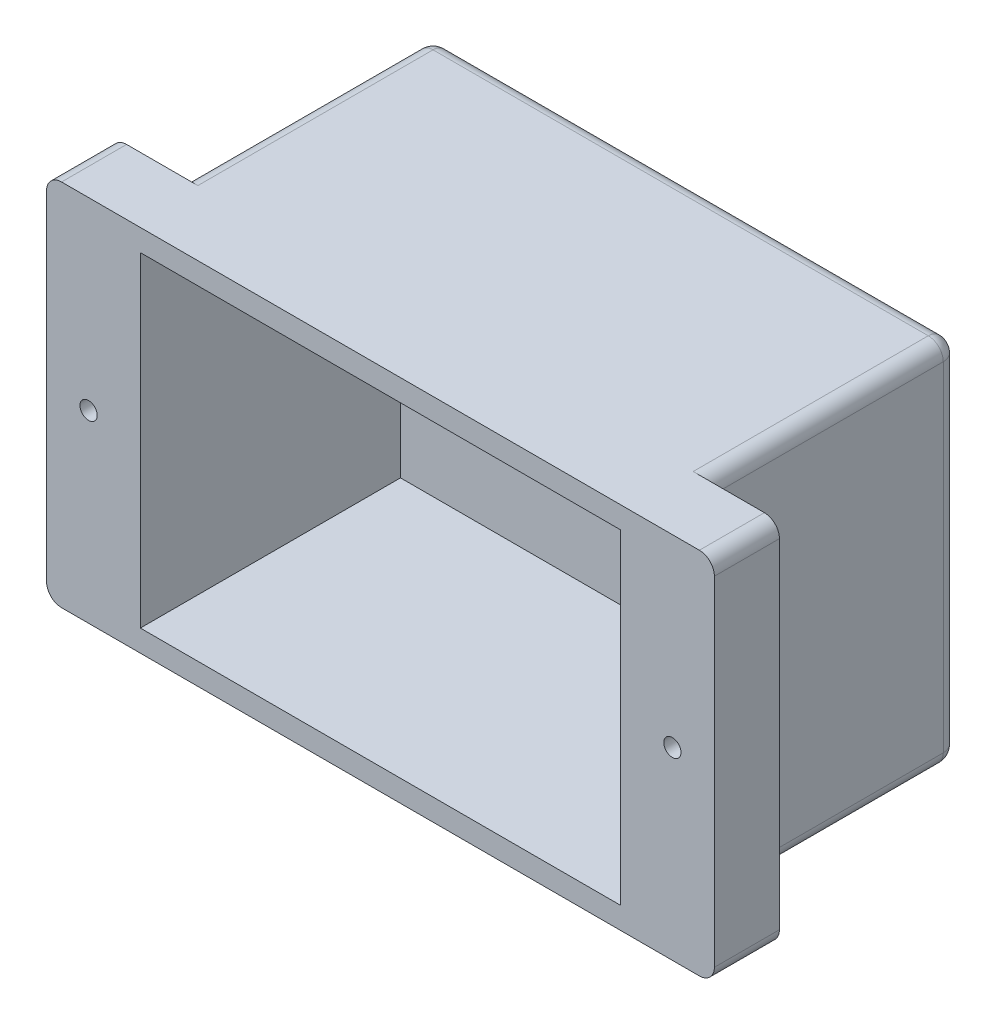
ISO-10303-21;
HEADER;
FILE_DESCRIPTION(('STEP AP214'),'2;1');
FILE_NAME('part.step','',(''),(''),'','','');
FILE_SCHEMA(('AUTOMOTIVE_DESIGN { 1 0 10303 214 1 1 1 1 }'));
ENDSEC;
DATA;
#1=APPLICATION_CONTEXT('core data for automotive mechanical design processes');
#2=APPLICATION_PROTOCOL_DEFINITION('international standard','automotive_design',2000,#1);
#3=PRODUCT_CONTEXT('',#1,'mechanical');
#4=PRODUCT('Part','Part','',(#3));
#5=PRODUCT_RELATED_PRODUCT_CATEGORY('part','',(#4));
#6=PRODUCT_DEFINITION_FORMATION('','',#4);
#7=PRODUCT_DEFINITION_CONTEXT('part definition',#1,'design');
#8=PRODUCT_DEFINITION('design','',#6,#7);
#9=PRODUCT_DEFINITION_SHAPE('','',#8);
#10=(LENGTH_UNIT() NAMED_UNIT(*) SI_UNIT(.MILLI.,.METRE.));
#11=(NAMED_UNIT(*) PLANE_ANGLE_UNIT() SI_UNIT($,.RADIAN.));
#12=(NAMED_UNIT(*) SI_UNIT($,.STERADIAN.) SOLID_ANGLE_UNIT());
#13=UNCERTAINTY_MEASURE_WITH_UNIT(LENGTH_MEASURE(1.E-05),#10,'distance_accuracy_value','');
#14=(GEOMETRIC_REPRESENTATION_CONTEXT(3) GLOBAL_UNCERTAINTY_ASSIGNED_CONTEXT((#13)) GLOBAL_UNIT_ASSIGNED_CONTEXT((#10,
#11,#12)) REPRESENTATION_CONTEXT('',''));
#15=CARTESIAN_POINT('',(0.,0.,0.));
#16=DIRECTION('',(0.,0.,1.));
#17=DIRECTION('',(1.,0.,0.));
#18=AXIS2_PLACEMENT_3D('',#15,#16,#17);
#19=CARTESIAN_POINT('',(0.,0.,-5.5));
#20=DIRECTION('',(0.,0.,1.));
#21=DIRECTION('',(1.,0.,0.));
#22=AXIS2_PLACEMENT_3D('',#19,#20,#21);
#23=PLANE('',#22);
#24=CARTESIAN_POINT('',(58.35,0.,-5.5));
#25=DIRECTION('',(0.,0.,1.));
#26=DIRECTION('',(1.,0.,0.));
#27=AXIS2_PLACEMENT_3D('',#24,#25,#26);
#28=CIRCLE('',#27,1.725);
#29=CARTESIAN_POINT('',(60.075,0.,-5.5));
#30=VERTEX_POINT('',#29);
#31=EDGE_CURVE('E276',#30,#30,#28,.T.);
#32=ORIENTED_EDGE('',*,*,#31,.T.);
#33=EDGE_LOOP('',(#32));
#34=FACE_BOUND('',#33,.T.);
#35=DIRECTION('',(0.,1.,0.));
#36=VECTOR('',#35,1.);
#37=CARTESIAN_POINT('',(66.75,-36.85,-5.5));
#38=LINE('',#37,#36);
#39=CARTESIAN_POINT('',(66.75,-33.85,-5.5));
#40=VERTEX_POINT('',#39);
#41=CARTESIAN_POINT('',(66.75,33.85,-5.5));
#42=VERTEX_POINT('',#41);
#43=EDGE_CURVE('E292',#40,#42,#38,.T.);
#44=ORIENTED_EDGE('',*,*,#43,.F.);
#45=CARTESIAN_POINT('',(63.75,-33.85,-5.5));
#46=DIRECTION('',(0.,0.,1.));
#47=DIRECTION('',(1.,0.,0.));
#48=AXIS2_PLACEMENT_3D('',#45,#46,#47);
#49=CIRCLE('',#48,3.);
#50=CARTESIAN_POINT('',(63.75,-36.85,-5.5));
#51=VERTEX_POINT('',#50);
#52=EDGE_CURVE('E329',#40,#51,#49,.F.);
#53=ORIENTED_EDGE('',*,*,#52,.T.);
#54=DIRECTION('',(1.,0.,0.));
#55=VECTOR('',#54,1.);
#56=CARTESIAN_POINT('',(66.75,-36.85,-5.5));
#57=LINE('',#56,#55);
#58=CARTESIAN_POINT('',(49.5,-36.85,-5.5));
#59=VERTEX_POINT('',#58);
#60=EDGE_CURVE('E288',#59,#51,#57,.T.);
#61=ORIENTED_EDGE('',*,*,#60,.F.);
#62=CARTESIAN_POINT('',(49.5,-33.85,-5.5));
#63=DIRECTION('',(0.,0.,1.));
#64=DIRECTION('',(1.,0.,0.));
#65=AXIS2_PLACEMENT_3D('',#62,#63,#64);
#66=CIRCLE('',#65,3.);
#67=CARTESIAN_POINT('',(52.5,-33.85,-5.5));
#68=VERTEX_POINT('',#67);
#69=EDGE_CURVE('E402',#59,#68,#66,.T.);
#70=ORIENTED_EDGE('',*,*,#69,.T.);
#71=DIRECTION('',(0.,-1.,0.));
#72=VECTOR('',#71,1.);
#73=CARTESIAN_POINT('',(52.5,-36.85,-5.5));
#74=LINE('',#73,#72);
#75=CARTESIAN_POINT('',(52.5,33.85,-5.5));
#76=VERTEX_POINT('',#75);
#77=EDGE_CURVE('E240',#76,#68,#74,.T.);
#78=ORIENTED_EDGE('',*,*,#77,.F.);
#79=CARTESIAN_POINT('',(49.5,33.85,-5.5));
#80=DIRECTION('',(0.,0.,1.));
#81=DIRECTION('',(1.,0.,0.));
#82=AXIS2_PLACEMENT_3D('',#79,#80,#81);
#83=CIRCLE('',#82,3.);
#84=CARTESIAN_POINT('',(49.5,36.85,-5.5));
#85=VERTEX_POINT('',#84);
#86=EDGE_CURVE('E11',#76,#85,#83,.T.);
#87=ORIENTED_EDGE('',*,*,#86,.T.);
#88=DIRECTION('',(-1.,0.,0.));
#89=VECTOR('',#88,1.);
#90=CARTESIAN_POINT('',(66.75,36.85,-5.5));
#91=LINE('',#90,#89);
#92=CARTESIAN_POINT('',(63.75,36.85,-5.5));
#93=VERTEX_POINT('',#92);
#94=EDGE_CURVE('E297',#93,#85,#91,.T.);
#95=ORIENTED_EDGE('',*,*,#94,.F.);
#96=CARTESIAN_POINT('',(63.75,33.85,-5.5));
#97=DIRECTION('',(0.,0.,1.));
#98=DIRECTION('',(1.,0.,0.));
#99=AXIS2_PLACEMENT_3D('',#96,#97,#98);
#100=CIRCLE('',#99,3.);
#101=EDGE_CURVE('E326',#93,#42,#100,.F.);
#102=ORIENTED_EDGE('',*,*,#101,.T.);
#103=EDGE_LOOP('',(#44,#53,#61,#70,#78,#87,#95,#102));
#104=FACE_BOUND('',#103,.T.);
#105=ADVANCED_FACE('F39',(#34,#104),#23,.F.);
#106=CARTESIAN_POINT('',(-58.35,0.,-5.5));
#107=DIRECTION('',(0.,0.,1.));
#108=DIRECTION('',(1.,0.,0.));
#109=AXIS2_PLACEMENT_3D('',#106,#107,#108);
#110=CIRCLE('',#109,1.725);
#111=CARTESIAN_POINT('',(-56.625,0.,-5.5));
#112=VERTEX_POINT('',#111);
#113=EDGE_CURVE('E280',#112,#112,#110,.T.);
#114=ORIENTED_EDGE('',*,*,#113,.T.);
#115=EDGE_LOOP('',(#114));
#116=FACE_BOUND('',#115,.T.);
#117=CARTESIAN_POINT('',(-63.75,-36.85,-5.5));
#118=VERTEX_POINT('',#117);
#119=CARTESIAN_POINT('',(-49.5,-36.85,-5.5));
#120=VERTEX_POINT('',#119);
#121=EDGE_CURVE('E289',#118,#120,#57,.T.);
#122=ORIENTED_EDGE('',*,*,#121,.F.);
#123=CARTESIAN_POINT('',(-63.75,-33.85,-5.5));
#124=DIRECTION('',(0.,0.,1.));
#125=DIRECTION('',(1.,0.,0.));
#126=AXIS2_PLACEMENT_3D('',#123,#124,#125);
#127=CIRCLE('',#126,3.);
#128=CARTESIAN_POINT('',(-66.75,-33.85,-5.5));
#129=VERTEX_POINT('',#128);
#130=EDGE_CURVE('E342',#118,#129,#127,.F.);
#131=ORIENTED_EDGE('',*,*,#130,.T.);
#132=DIRECTION('',(0.,-1.,0.));
#133=VECTOR('',#132,1.);
#134=CARTESIAN_POINT('',(-66.75,-36.85,-5.5));
#135=LINE('',#134,#133);
#136=CARTESIAN_POINT('',(-66.75,33.85,-5.5));
#137=VERTEX_POINT('',#136);
#138=EDGE_CURVE('E284',#137,#129,#135,.T.);
#139=ORIENTED_EDGE('',*,*,#138,.F.);
#140=CARTESIAN_POINT('',(-63.75,33.85,-5.5));
#141=DIRECTION('',(0.,0.,1.));
#142=DIRECTION('',(1.,0.,0.));
#143=AXIS2_PLACEMENT_3D('',#140,#141,#142);
#144=CIRCLE('',#143,3.);
#145=CARTESIAN_POINT('',(-63.75,36.85,-5.5));
#146=VERTEX_POINT('',#145);
#147=EDGE_CURVE('E339',#137,#146,#144,.F.);
#148=ORIENTED_EDGE('',*,*,#147,.T.);
#149=CARTESIAN_POINT('',(-49.5,36.85,-5.5));
#150=VERTEX_POINT('',#149);
#151=EDGE_CURVE('E296',#150,#146,#91,.T.);
#152=ORIENTED_EDGE('',*,*,#151,.F.);
#153=CARTESIAN_POINT('',(-49.5,33.85,-5.5));
#154=DIRECTION('',(0.,0.,1.));
#155=DIRECTION('',(1.,0.,0.));
#156=AXIS2_PLACEMENT_3D('',#153,#154,#155);
#157=CIRCLE('',#156,3.);
#158=CARTESIAN_POINT('',(-52.5,33.85,-5.5));
#159=VERTEX_POINT('',#158);
#160=EDGE_CURVE('E49',#150,#159,#157,.T.);
#161=ORIENTED_EDGE('',*,*,#160,.T.);
#162=DIRECTION('',(0.,1.,0.));
#163=VECTOR('',#162,1.);
#164=CARTESIAN_POINT('',(-52.5,-36.85,-5.5));
#165=LINE('',#164,#163);
#166=CARTESIAN_POINT('',(-52.5,-33.85,-5.5));
#167=VERTEX_POINT('',#166);
#168=EDGE_CURVE('E248',#167,#159,#165,.T.);
#169=ORIENTED_EDGE('',*,*,#168,.F.);
#170=CARTESIAN_POINT('',(-49.5,-33.85,-5.5));
#171=DIRECTION('',(0.,0.,1.));
#172=DIRECTION('',(1.,0.,0.));
#173=AXIS2_PLACEMENT_3D('',#170,#171,#172);
#174=CIRCLE('',#173,3.);
#175=EDGE_CURVE('E405',#167,#120,#174,.T.);
#176=ORIENTED_EDGE('',*,*,#175,.T.);
#177=EDGE_LOOP('',(#122,#131,#139,#148,#152,#161,#169,#176));
#178=FACE_BOUND('',#177,.T.);
#179=ADVANCED_FACE('F545',(#116,#178),#23,.F.);
#180=CARTESIAN_POINT('',(-66.75,-36.85,-5.5));
#181=DIRECTION('',(-1.,0.,0.));
#182=DIRECTION('',(0.,0.,1.));
#183=AXIS2_PLACEMENT_3D('',#180,#181,#182);
#184=PLANE('',#183);
#185=ORIENTED_EDGE('',*,*,#138,.T.);
#186=DIRECTION('',(0.,0.,1.));
#187=VECTOR('',#186,1.);
#188=CARTESIAN_POINT('',(-66.75,-33.85,-5.5));
#189=LINE('',#188,#187);
#190=CARTESIAN_POINT('',(-66.75,-33.85,7.5));
#191=VERTEX_POINT('',#190);
#192=EDGE_CURVE('E335',#129,#191,#189,.T.);
#193=ORIENTED_EDGE('',*,*,#192,.T.);
#194=DIRECTION('',(0.,-1.,0.));
#195=VECTOR('',#194,1.);
#196=CARTESIAN_POINT('',(-66.75,-36.85,7.5));
#197=LINE('',#196,#195);
#198=CARTESIAN_POINT('',(-66.75,33.85,7.5));
#199=VERTEX_POINT('',#198);
#200=EDGE_CURVE('E260',#199,#191,#197,.T.);
#201=ORIENTED_EDGE('',*,*,#200,.F.);
#202=DIRECTION('',(0.,0.,1.));
#203=VECTOR('',#202,1.);
#204=CARTESIAN_POINT('',(-66.75,33.85,-5.5));
#205=LINE('',#204,#203);
#206=EDGE_CURVE('E332',#199,#137,#205,.F.);
#207=ORIENTED_EDGE('',*,*,#206,.T.);
#208=EDGE_LOOP('',(#185,#193,#201,#207));
#209=FACE_BOUND('',#208,.T.);
#210=ADVANCED_FACE('F538',(#209),#184,.T.);
#211=CARTESIAN_POINT('',(66.75,36.85,-5.5));
#212=DIRECTION('',(0.,1.,0.));
#213=DIRECTION('',(-1.,0.,0.));
#214=AXIS2_PLACEMENT_3D('',#211,#212,#213);
#215=PLANE('',#214);
#216=DIRECTION('',(0.,0.,1.));
#217=VECTOR('',#216,1.);
#218=CARTESIAN_POINT('',(-49.5,36.85,-5.5));
#219=LINE('',#218,#217);
#220=CARTESIAN_POINT('',(-49.5,36.85,-52.5));
#221=VERTEX_POINT('',#220);
#222=EDGE_CURVE('E372',#221,#150,#219,.T.);
#223=ORIENTED_EDGE('',*,*,#222,.T.);
#224=ORIENTED_EDGE('',*,*,#151,.T.);
#225=DIRECTION('',(0.,0.,1.));
#226=VECTOR('',#225,1.);
#227=CARTESIAN_POINT('',(-63.75,36.85,-5.5));
#228=LINE('',#227,#226);
#229=CARTESIAN_POINT('',(-63.75,36.85,7.5));
#230=VERTEX_POINT('',#229);
#231=EDGE_CURVE('E348',#146,#230,#228,.T.);
#232=ORIENTED_EDGE('',*,*,#231,.T.);
#233=DIRECTION('',(-1.,0.,0.));
#234=VECTOR('',#233,1.);
#235=CARTESIAN_POINT('',(66.75,36.85,7.5));
#236=LINE('',#235,#234);
#237=CARTESIAN_POINT('',(63.75,36.85,7.5));
#238=VERTEX_POINT('',#237);
#239=EDGE_CURVE('E272',#238,#230,#236,.T.);
#240=ORIENTED_EDGE('',*,*,#239,.F.);
#241=DIRECTION('',(0.,0.,1.));
#242=VECTOR('',#241,1.);
#243=CARTESIAN_POINT('',(63.75,36.85,-5.5));
#244=LINE('',#243,#242);
#245=EDGE_CURVE('E345',#238,#93,#244,.F.);
#246=ORIENTED_EDGE('',*,*,#245,.T.);
#247=ORIENTED_EDGE('',*,*,#94,.T.);
#248=DIRECTION('',(0.,0.,1.));
#249=VECTOR('',#248,1.);
#250=CARTESIAN_POINT('',(49.5,36.85,-55.5));
#251=LINE('',#250,#249);
#252=CARTESIAN_POINT('',(49.5,36.85,-52.5));
#253=VERTEX_POINT('',#252);
#254=EDGE_CURVE('E365',#85,#253,#251,.F.);
#255=ORIENTED_EDGE('',*,*,#254,.T.);
#256=DIRECTION('',(1.,0.,0.));
#257=VECTOR('',#256,1.);
#258=CARTESIAN_POINT('',(66.75,36.85,-52.5));
#259=LINE('',#258,#257);
#260=EDGE_CURVE('E368',#253,#221,#259,.F.);
#261=ORIENTED_EDGE('',*,*,#260,.T.);
#262=EDGE_LOOP('',(#223,#224,#232,#240,#246,#247,#255,#261));
#263=FACE_BOUND('',#262,.T.);
#264=ADVANCED_FACE('F504',(#263),#215,.T.);
#265=CARTESIAN_POINT('',(66.75,-36.85,-5.5));
#266=DIRECTION('',(1.,0.,0.));
#267=DIRECTION('',(0.,0.,-1.));
#268=AXIS2_PLACEMENT_3D('',#265,#266,#267);
#269=PLANE('',#268);
#270=DIRECTION('',(0.,1.,0.));
#271=VECTOR('',#270,1.);
#272=CARTESIAN_POINT('',(66.75,-36.85,7.5));
#273=LINE('',#272,#271);
#274=CARTESIAN_POINT('',(66.75,-33.85,7.5));
#275=VERTEX_POINT('',#274);
#276=CARTESIAN_POINT('',(66.75,33.85,7.5));
#277=VERTEX_POINT('',#276);
#278=EDGE_CURVE('E268',#275,#277,#273,.T.);
#279=ORIENTED_EDGE('',*,*,#278,.F.);
#280=DIRECTION('',(0.,0.,1.));
#281=VECTOR('',#280,1.);
#282=CARTESIAN_POINT('',(66.75,-33.85,-5.5));
#283=LINE('',#282,#281);
#284=EDGE_CURVE('E323',#275,#40,#283,.F.);
#285=ORIENTED_EDGE('',*,*,#284,.T.);
#286=ORIENTED_EDGE('',*,*,#43,.T.);
#287=DIRECTION('',(0.,0.,1.));
#288=VECTOR('',#287,1.);
#289=CARTESIAN_POINT('',(66.75,33.85,-5.5));
#290=LINE('',#289,#288);
#291=EDGE_CURVE('E319',#42,#277,#290,.T.);
#292=ORIENTED_EDGE('',*,*,#291,.T.);
#293=EDGE_LOOP('',(#279,#285,#286,#292));
#294=FACE_BOUND('',#293,.T.);
#295=ADVANCED_FACE('F517',(#294),#269,.T.);
#296=CARTESIAN_POINT('',(66.75,-36.85,-5.5));
#297=DIRECTION('',(0.,-1.,0.));
#298=DIRECTION('',(1.,0.,0.));
#299=AXIS2_PLACEMENT_3D('',#296,#297,#298);
#300=PLANE('',#299);
#301=DIRECTION('',(0.,0.,1.));
#302=VECTOR('',#301,1.);
#303=CARTESIAN_POINT('',(49.5,-36.85,-5.5));
#304=LINE('',#303,#302);
#305=CARTESIAN_POINT('',(49.5,-36.85,-52.5));
#306=VERTEX_POINT('',#305);
#307=EDGE_CURVE('E391',#306,#59,#304,.T.);
#308=ORIENTED_EDGE('',*,*,#307,.T.);
#309=ORIENTED_EDGE('',*,*,#60,.T.);
#310=DIRECTION('',(0.,0.,1.));
#311=VECTOR('',#310,1.);
#312=CARTESIAN_POINT('',(63.75,-36.85,-5.5));
#313=LINE('',#312,#311);
#314=CARTESIAN_POINT('',(63.75,-36.85,7.5));
#315=VERTEX_POINT('',#314);
#316=EDGE_CURVE('E303',#51,#315,#313,.T.);
#317=ORIENTED_EDGE('',*,*,#316,.T.);
#318=DIRECTION('',(1.,0.,0.));
#319=VECTOR('',#318,1.);
#320=CARTESIAN_POINT('',(66.75,-36.85,7.5));
#321=LINE('',#320,#319);
#322=CARTESIAN_POINT('',(-63.75,-36.85,7.5));
#323=VERTEX_POINT('',#322);
#324=EDGE_CURVE('E264',#323,#315,#321,.T.);
#325=ORIENTED_EDGE('',*,*,#324,.F.);
#326=DIRECTION('',(0.,0.,1.));
#327=VECTOR('',#326,1.);
#328=CARTESIAN_POINT('',(-63.75,-36.85,-5.5));
#329=LINE('',#328,#327);
#330=EDGE_CURVE('E300',#323,#118,#329,.F.);
#331=ORIENTED_EDGE('',*,*,#330,.T.);
#332=ORIENTED_EDGE('',*,*,#121,.T.);
#333=DIRECTION('',(0.,0.,1.));
#334=VECTOR('',#333,1.);
#335=CARTESIAN_POINT('',(-49.5,-36.85,-55.5));
#336=LINE('',#335,#334);
#337=CARTESIAN_POINT('',(-49.5,-36.85,-52.5));
#338=VERTEX_POINT('',#337);
#339=EDGE_CURVE('E385',#120,#338,#336,.F.);
#340=ORIENTED_EDGE('',*,*,#339,.T.);
#341=DIRECTION('',(-1.,0.,0.));
#342=VECTOR('',#341,1.);
#343=CARTESIAN_POINT('',(66.75,-36.85,-52.5));
#344=LINE('',#343,#342);
#345=EDGE_CURVE('E388',#338,#306,#344,.F.);
#346=ORIENTED_EDGE('',*,*,#345,.T.);
#347=EDGE_LOOP('',(#308,#309,#317,#325,#331,#332,#340,#346));
#348=FACE_BOUND('',#347,.T.);
#349=ADVANCED_FACE('F479',(#348),#300,.T.);
#350=CARTESIAN_POINT('',(-58.35,0.,-5.5));
#351=DIRECTION('',(0.,0.,1.));
#352=DIRECTION('',(1.,0.,0.));
#353=AXIS2_PLACEMENT_3D('',#350,#351,#352);
#354=CYLINDRICAL_SURFACE('',#353,1.725);
#355=ORIENTED_EDGE('',*,*,#113,.F.);
#356=EDGE_LOOP('',(#355));
#357=FACE_BOUND('',#356,.T.);
#358=CARTESIAN_POINT('',(-58.35,0.,7.5));
#359=DIRECTION('',(0.,0.,1.));
#360=DIRECTION('',(1.,0.,0.));
#361=AXIS2_PLACEMENT_3D('',#358,#359,#360);
#362=CIRCLE('',#361,1.725);
#363=CARTESIAN_POINT('',(-56.625,0.,7.5));
#364=VERTEX_POINT('',#363);
#365=EDGE_CURVE('E256',#364,#364,#362,.T.);
#366=ORIENTED_EDGE('',*,*,#365,.T.);
#367=EDGE_LOOP('',(#366));
#368=FACE_BOUND('',#367,.T.);
#369=ADVANCED_FACE('F563',(#357,#368),#354,.F.);
#370=CARTESIAN_POINT('',(58.35,0.,-5.5));
#371=DIRECTION('',(0.,0.,1.));
#372=DIRECTION('',(1.,0.,0.));
#373=AXIS2_PLACEMENT_3D('',#370,#371,#372);
#374=CYLINDRICAL_SURFACE('',#373,1.725);
#375=ORIENTED_EDGE('',*,*,#31,.F.);
#376=EDGE_LOOP('',(#375));
#377=FACE_BOUND('',#376,.T.);
#378=CARTESIAN_POINT('',(58.35,0.,7.5));
#379=DIRECTION('',(0.,0.,1.));
#380=DIRECTION('',(1.,0.,0.));
#381=AXIS2_PLACEMENT_3D('',#378,#379,#380);
#382=CIRCLE('',#381,1.725);
#383=CARTESIAN_POINT('',(60.075,0.,7.5));
#384=VERTEX_POINT('',#383);
#385=EDGE_CURVE('E252',#384,#384,#382,.T.);
#386=ORIENTED_EDGE('',*,*,#385,.T.);
#387=EDGE_LOOP('',(#386));
#388=FACE_BOUND('',#387,.T.);
#389=ADVANCED_FACE('F792',(#377,#388),#374,.F.);
#390=CARTESIAN_POINT('',(0.,0.,7.5));
#391=DIRECTION('',(0.,0.,1.));
#392=DIRECTION('',(1.,0.,0.));
#393=AXIS2_PLACEMENT_3D('',#390,#391,#392);
#394=PLANE('',#393);
#395=DIRECTION('',(0.,-1.,0.));
#396=VECTOR('',#395,1.);
#397=CARTESIAN_POINT('',(-48.,-32.5,7.5));
#398=LINE('',#397,#396);
#399=CARTESIAN_POINT('',(-48.,32.5,7.5));
#400=VERTEX_POINT('',#399);
#401=CARTESIAN_POINT('',(-48.,-32.5,7.5));
#402=VERTEX_POINT('',#401);
#403=EDGE_CURVE('E198',#400,#402,#398,.T.);
#404=ORIENTED_EDGE('',*,*,#403,.F.);
#405=DIRECTION('',(-1.,0.,0.));
#406=VECTOR('',#405,1.);
#407=CARTESIAN_POINT('',(48.,32.5,7.5));
#408=LINE('',#407,#406);
#409=CARTESIAN_POINT('',(48.,32.5,7.5));
#410=VERTEX_POINT('',#409);
#411=EDGE_CURVE('E218',#410,#400,#408,.T.);
#412=ORIENTED_EDGE('',*,*,#411,.F.);
#413=DIRECTION('',(0.,1.,0.));
#414=VECTOR('',#413,1.);
#415=CARTESIAN_POINT('',(48.,-32.5,7.5));
#416=LINE('',#415,#414);
#417=CARTESIAN_POINT('',(48.,-32.5,7.5));
#418=VERTEX_POINT('',#417);
#419=EDGE_CURVE('E222',#418,#410,#416,.T.);
#420=ORIENTED_EDGE('',*,*,#419,.F.);
#421=DIRECTION('',(1.,0.,0.));
#422=VECTOR('',#421,1.);
#423=CARTESIAN_POINT('',(48.,-32.5,7.5));
#424=LINE('',#423,#422);
#425=EDGE_CURVE('E231',#402,#418,#424,.T.);
#426=ORIENTED_EDGE('',*,*,#425,.F.);
#427=EDGE_LOOP('',(#404,#412,#420,#426));
#428=FACE_BOUND('',#427,.T.);
#429=ORIENTED_EDGE('',*,*,#365,.F.);
#430=EDGE_LOOP('',(#429));
#431=FACE_BOUND('',#430,.T.);
#432=ORIENTED_EDGE('',*,*,#324,.T.);
#433=CARTESIAN_POINT('',(63.75,-33.85,7.5));
#434=DIRECTION('',(0.,0.,1.));
#435=DIRECTION('',(1.,0.,0.));
#436=AXIS2_PLACEMENT_3D('',#433,#434,#435);
#437=CIRCLE('',#436,3.);
#438=EDGE_CURVE('E316',#315,#275,#437,.T.);
#439=ORIENTED_EDGE('',*,*,#438,.T.);
#440=ORIENTED_EDGE('',*,*,#278,.T.);
#441=CARTESIAN_POINT('',(63.75,33.85,7.5));
#442=DIRECTION('',(0.,0.,1.));
#443=DIRECTION('',(1.,0.,0.));
#444=AXIS2_PLACEMENT_3D('',#441,#442,#443);
#445=CIRCLE('',#444,3.);
#446=EDGE_CURVE('E307',#277,#238,#445,.T.);
#447=ORIENTED_EDGE('',*,*,#446,.T.);
#448=ORIENTED_EDGE('',*,*,#239,.T.);
#449=CARTESIAN_POINT('',(-63.75,33.85,7.5));
#450=DIRECTION('',(0.,0.,1.));
#451=DIRECTION('',(1.,0.,0.));
#452=AXIS2_PLACEMENT_3D('',#449,#450,#451);
#453=CIRCLE('',#452,3.);
#454=EDGE_CURVE('E310',#230,#199,#453,.T.);
#455=ORIENTED_EDGE('',*,*,#454,.T.);
#456=ORIENTED_EDGE('',*,*,#200,.T.);
#457=CARTESIAN_POINT('',(-63.75,-33.85,7.5));
#458=DIRECTION('',(0.,0.,1.));
#459=DIRECTION('',(1.,0.,0.));
#460=AXIS2_PLACEMENT_3D('',#457,#458,#459);
#461=CIRCLE('',#460,3.);
#462=EDGE_CURVE('E313',#191,#323,#461,.T.);
#463=ORIENTED_EDGE('',*,*,#462,.T.);
#464=EDGE_LOOP('',(#432,#439,#440,#447,#448,#455,#456,#463));
#465=FACE_BOUND('',#464,.T.);
#466=ORIENTED_EDGE('',*,*,#385,.F.);
#467=EDGE_LOOP('',(#466));
#468=FACE_BOUND('',#467,.T.);
#469=ADVANCED_FACE('F520',(#428,#431,#465,#468),#394,.T.);
#470=CARTESIAN_POINT('',(52.5,-36.85,-55.5));
#471=DIRECTION('',(-1.,0.,0.));
#472=DIRECTION('',(0.,0.,1.));
#473=AXIS2_PLACEMENT_3D('',#470,#471,#472);
#474=PLANE('',#473);
#475=ORIENTED_EDGE('',*,*,#77,.T.);
#476=DIRECTION('',(0.,0.,1.));
#477=VECTOR('',#476,1.);
#478=CARTESIAN_POINT('',(52.5,-33.85,-55.5));
#479=LINE('',#478,#477);
#480=CARTESIAN_POINT('',(52.5,-33.85,-52.5));
#481=VERTEX_POINT('',#480);
#482=EDGE_CURVE('E57',#68,#481,#479,.F.);
#483=ORIENTED_EDGE('',*,*,#482,.T.);
#484=DIRECTION('',(0.,-1.,0.));
#485=VECTOR('',#484,1.);
#486=CARTESIAN_POINT('',(52.5,36.85,-52.5));
#487=LINE('',#486,#485);
#488=CARTESIAN_POINT('',(52.5,33.85,-52.5));
#489=VERTEX_POINT('',#488);
#490=EDGE_CURVE('E62',#481,#489,#487,.F.);
#491=ORIENTED_EDGE('',*,*,#490,.T.);
#492=DIRECTION('',(0.,0.,1.));
#493=VECTOR('',#492,1.);
#494=CARTESIAN_POINT('',(52.5,33.85,-5.5));
#495=LINE('',#494,#493);
#496=EDGE_CURVE('E395',#489,#76,#495,.T.);
#497=ORIENTED_EDGE('',*,*,#496,.T.);
#498=EDGE_LOOP('',(#475,#483,#491,#497));
#499=FACE_BOUND('',#498,.T.);
#500=ADVANCED_FACE('F489',(#499),#474,.F.);
#501=CARTESIAN_POINT('',(-52.5,-36.85,-55.5));
#502=DIRECTION('',(1.,0.,0.));
#503=DIRECTION('',(0.,0.,-1.));
#504=AXIS2_PLACEMENT_3D('',#501,#502,#503);
#505=PLANE('',#504);
#506=DIRECTION('',(0.,1.,0.));
#507=VECTOR('',#506,1.);
#508=CARTESIAN_POINT('',(-52.5,-36.85,-52.5));
#509=LINE('',#508,#507);
#510=CARTESIAN_POINT('',(-52.5,33.85,-52.5));
#511=VERTEX_POINT('',#510);
#512=CARTESIAN_POINT('',(-52.5,-33.85,-52.5));
#513=VERTEX_POINT('',#512);
#514=EDGE_CURVE('E379',#511,#513,#509,.F.);
#515=ORIENTED_EDGE('',*,*,#514,.T.);
#516=DIRECTION('',(0.,0.,1.));
#517=VECTOR('',#516,1.);
#518=CARTESIAN_POINT('',(-52.5,-33.85,-5.5));
#519=LINE('',#518,#517);
#520=EDGE_CURVE('E382',#513,#167,#519,.T.);
#521=ORIENTED_EDGE('',*,*,#520,.T.);
#522=ORIENTED_EDGE('',*,*,#168,.T.);
#523=DIRECTION('',(0.,0.,1.));
#524=VECTOR('',#523,1.);
#525=CARTESIAN_POINT('',(-52.5,33.85,-55.5));
#526=LINE('',#525,#524);
#527=EDGE_CURVE('E376',#159,#511,#526,.F.);
#528=ORIENTED_EDGE('',*,*,#527,.T.);
#529=EDGE_LOOP('',(#515,#521,#522,#528));
#530=FACE_BOUND('',#529,.T.);
#531=ADVANCED_FACE('F742',(#530),#505,.F.);
#532=CARTESIAN_POINT('',(0.,0.,-55.5));
#533=DIRECTION('',(0.,0.,-1.));
#534=DIRECTION('',(-1.,0.,0.));
#535=AXIS2_PLACEMENT_3D('',#532,#533,#534);
#536=PLANE('',#535);
#537=DIRECTION('',(0.,1.,0.));
#538=VECTOR('',#537,1.);
#539=CARTESIAN_POINT('',(-49.5,36.85,-55.5));
#540=LINE('',#539,#538);
#541=CARTESIAN_POINT('',(-49.5,-33.85,-55.5));
#542=VERTEX_POINT('',#541);
#543=CARTESIAN_POINT('',(-49.5,33.85,-55.5));
#544=VERTEX_POINT('',#543);
#545=EDGE_CURVE('E358',#542,#544,#540,.T.);
#546=ORIENTED_EDGE('',*,*,#545,.T.);
#547=DIRECTION('',(1.,0.,0.));
#548=VECTOR('',#547,1.);
#549=CARTESIAN_POINT('',(0.,33.85,-55.5));
#550=LINE('',#549,#548);
#551=CARTESIAN_POINT('',(49.5,33.85,-55.5));
#552=VERTEX_POINT('',#551);
#553=EDGE_CURVE('E361',#544,#552,#550,.T.);
#554=ORIENTED_EDGE('',*,*,#553,.T.);
#555=DIRECTION('',(0.,-1.,0.));
#556=VECTOR('',#555,1.);
#557=CARTESIAN_POINT('',(49.5,-36.85,-55.5));
#558=LINE('',#557,#556);
#559=CARTESIAN_POINT('',(49.5,-33.85,-55.5));
#560=VERTEX_POINT('',#559);
#561=EDGE_CURVE('E352',#552,#560,#558,.T.);
#562=ORIENTED_EDGE('',*,*,#561,.T.);
#563=DIRECTION('',(-1.,0.,0.));
#564=VECTOR('',#563,1.);
#565=CARTESIAN_POINT('',(0.,-33.85,-55.5));
#566=LINE('',#565,#564);
#567=EDGE_CURVE('E355',#560,#542,#566,.T.);
#568=ORIENTED_EDGE('',*,*,#567,.T.);
#569=EDGE_LOOP('',(#546,#554,#562,#568));
#570=FACE_BOUND('',#569,.T.);
#571=ADVANCED_FACE('F469',(#570),#536,.T.);
#572=CARTESIAN_POINT('',(-48.,-32.5,-44.5));
#573=DIRECTION('',(-1.,0.,0.));
#574=DIRECTION('',(0.,0.,1.));
#575=AXIS2_PLACEMENT_3D('',#572,#573,#574);
#576=PLANE('',#575);
#577=ORIENTED_EDGE('',*,*,#403,.T.);
#578=DIRECTION('',(0.,0.,1.));
#579=VECTOR('',#578,1.);
#580=CARTESIAN_POINT('',(-48.,-32.5,-44.5));
#581=LINE('',#580,#579);
#582=CARTESIAN_POINT('',(-48.,-32.5,-44.5));
#583=VERTEX_POINT('',#582);
#584=EDGE_CURVE('E191',#583,#402,#581,.T.);
#585=ORIENTED_EDGE('',*,*,#584,.F.);
#586=DIRECTION('',(0.,-1.,0.));
#587=VECTOR('',#586,1.);
#588=CARTESIAN_POINT('',(-48.,-32.5,-44.5));
#589=LINE('',#588,#587);
#590=CARTESIAN_POINT('',(-48.,32.5,-44.5));
#591=VERTEX_POINT('',#590);
#592=EDGE_CURVE('E195',#591,#583,#589,.T.);
#593=ORIENTED_EDGE('',*,*,#592,.F.);
#594=DIRECTION('',(0.,0.,1.));
#595=VECTOR('',#594,1.);
#596=CARTESIAN_POINT('',(-48.,32.5,-44.5));
#597=LINE('',#596,#595);
#598=EDGE_CURVE('E237',#591,#400,#597,.T.);
#599=ORIENTED_EDGE('',*,*,#598,.T.);
#600=EDGE_LOOP('',(#577,#585,#593,#599));
#601=FACE_BOUND('',#600,.T.);
#602=ADVANCED_FACE('F193',(#601),#576,.F.);
#603=CARTESIAN_POINT('',(48.,32.5,-44.5));
#604=DIRECTION('',(0.,1.,0.));
#605=DIRECTION('',(-1.,0.,0.));
#606=AXIS2_PLACEMENT_3D('',#603,#604,#605);
#607=PLANE('',#606);
#608=ORIENTED_EDGE('',*,*,#411,.T.);
#609=ORIENTED_EDGE('',*,*,#598,.F.);
#610=DIRECTION('',(-1.,0.,0.));
#611=VECTOR('',#610,1.);
#612=CARTESIAN_POINT('',(48.,32.5,-44.5));
#613=LINE('',#612,#611);
#614=CARTESIAN_POINT('',(48.,32.5,-44.5));
#615=VERTEX_POINT('',#614);
#616=EDGE_CURVE('E204',#615,#591,#613,.T.);
#617=ORIENTED_EDGE('',*,*,#616,.F.);
#618=DIRECTION('',(0.,0.,1.));
#619=VECTOR('',#618,1.);
#620=CARTESIAN_POINT('',(48.,32.5,-44.5));
#621=LINE('',#620,#619);
#622=EDGE_CURVE('E241',#615,#410,#621,.T.);
#623=ORIENTED_EDGE('',*,*,#622,.T.);
#624=EDGE_LOOP('',(#608,#609,#617,#623));
#625=FACE_BOUND('',#624,.T.);
#626=ADVANCED_FACE('F718',(#625),#607,.F.);
#627=CARTESIAN_POINT('',(48.,-32.5,-44.5));
#628=DIRECTION('',(1.,0.,0.));
#629=DIRECTION('',(0.,0.,-1.));
#630=AXIS2_PLACEMENT_3D('',#627,#628,#629);
#631=PLANE('',#630);
#632=ORIENTED_EDGE('',*,*,#419,.T.);
#633=ORIENTED_EDGE('',*,*,#622,.F.);
#634=DIRECTION('',(0.,1.,0.));
#635=VECTOR('',#634,1.);
#636=CARTESIAN_POINT('',(48.,-32.5,-44.5));
#637=LINE('',#636,#635);
#638=CARTESIAN_POINT('',(48.,-32.5,-44.5));
#639=VERTEX_POINT('',#638);
#640=EDGE_CURVE('E213',#639,#615,#637,.T.);
#641=ORIENTED_EDGE('',*,*,#640,.F.);
#642=DIRECTION('',(0.,0.,1.));
#643=VECTOR('',#642,1.);
#644=CARTESIAN_POINT('',(48.,-32.5,-44.5));
#645=LINE('',#644,#643);
#646=EDGE_CURVE('E203',#639,#418,#645,.T.);
#647=ORIENTED_EDGE('',*,*,#646,.T.);
#648=EDGE_LOOP('',(#632,#633,#641,#647));
#649=FACE_BOUND('',#648,.T.);
#650=ADVANCED_FACE('F710',(#649),#631,.F.);
#651=CARTESIAN_POINT('',(48.,-32.5,-44.5));
#652=DIRECTION('',(0.,-1.,0.));
#653=DIRECTION('',(1.,0.,0.));
#654=AXIS2_PLACEMENT_3D('',#651,#652,#653);
#655=PLANE('',#654);
#656=ORIENTED_EDGE('',*,*,#425,.T.);
#657=ORIENTED_EDGE('',*,*,#646,.F.);
#658=DIRECTION('',(1.,0.,0.));
#659=VECTOR('',#658,1.);
#660=CARTESIAN_POINT('',(48.,-32.5,-44.5));
#661=LINE('',#660,#659);
#662=EDGE_CURVE('E207',#583,#639,#661,.T.);
#663=ORIENTED_EDGE('',*,*,#662,.F.);
#664=ORIENTED_EDGE('',*,*,#584,.T.);
#665=EDGE_LOOP('',(#656,#657,#663,#664));
#666=FACE_BOUND('',#665,.T.);
#667=ADVANCED_FACE('F208',(#666),#655,.F.);
#668=CARTESIAN_POINT('',(0.,0.,-44.5));
#669=DIRECTION('',(0.,0.,1.));
#670=DIRECTION('',(1.,0.,0.));
#671=AXIS2_PLACEMENT_3D('',#668,#669,#670);
#672=PLANE('',#671);
#673=ORIENTED_EDGE('',*,*,#592,.T.);
#674=ORIENTED_EDGE('',*,*,#662,.T.);
#675=ORIENTED_EDGE('',*,*,#640,.T.);
#676=ORIENTED_EDGE('',*,*,#616,.T.);
#677=EDGE_LOOP('',(#673,#674,#675,#676));
#678=FACE_BOUND('',#677,.T.);
#679=ADVANCED_FACE('F215',(#678),#672,.T.);
#680=CARTESIAN_POINT('',(63.75,-33.85,-5.5));
#681=DIRECTION('',(0.,0.,1.));
#682=DIRECTION('',(1.,0.,0.));
#683=AXIS2_PLACEMENT_3D('',#680,#681,#682);
#684=CYLINDRICAL_SURFACE('',#683,3.);
#685=ORIENTED_EDGE('',*,*,#52,.F.);
#686=ORIENTED_EDGE('',*,*,#284,.F.);
#687=ORIENTED_EDGE('',*,*,#438,.F.);
#688=ORIENTED_EDGE('',*,*,#316,.F.);
#689=EDGE_LOOP('',(#685,#686,#687,#688));
#690=FACE_BOUND('',#689,.T.);
#691=ADVANCED_FACE('F526',(#690),#684,.T.);
#692=CARTESIAN_POINT('',(-63.75,-33.85,-5.5));
#693=DIRECTION('',(0.,0.,1.));
#694=DIRECTION('',(1.,0.,0.));
#695=AXIS2_PLACEMENT_3D('',#692,#693,#694);
#696=CYLINDRICAL_SURFACE('',#695,3.);
#697=ORIENTED_EDGE('',*,*,#130,.F.);
#698=ORIENTED_EDGE('',*,*,#330,.F.);
#699=ORIENTED_EDGE('',*,*,#462,.F.);
#700=ORIENTED_EDGE('',*,*,#192,.F.);
#701=EDGE_LOOP('',(#697,#698,#699,#700));
#702=FACE_BOUND('',#701,.T.);
#703=ADVANCED_FACE('F543',(#702),#696,.T.);
#704=CARTESIAN_POINT('',(-63.75,33.85,-5.5));
#705=DIRECTION('',(0.,0.,1.));
#706=DIRECTION('',(1.,0.,0.));
#707=AXIS2_PLACEMENT_3D('',#704,#705,#706);
#708=CYLINDRICAL_SURFACE('',#707,3.);
#709=ORIENTED_EDGE('',*,*,#147,.F.);
#710=ORIENTED_EDGE('',*,*,#206,.F.);
#711=ORIENTED_EDGE('',*,*,#454,.F.);
#712=ORIENTED_EDGE('',*,*,#231,.F.);
#713=EDGE_LOOP('',(#709,#710,#711,#712));
#714=FACE_BOUND('',#713,.T.);
#715=ADVANCED_FACE('F534',(#714),#708,.T.);
#716=CARTESIAN_POINT('',(63.75,33.85,-5.5));
#717=DIRECTION('',(0.,0.,1.));
#718=DIRECTION('',(1.,0.,0.));
#719=AXIS2_PLACEMENT_3D('',#716,#717,#718);
#720=CYLINDRICAL_SURFACE('',#719,3.);
#721=ORIENTED_EDGE('',*,*,#101,.F.);
#722=ORIENTED_EDGE('',*,*,#245,.F.);
#723=ORIENTED_EDGE('',*,*,#446,.F.);
#724=ORIENTED_EDGE('',*,*,#291,.F.);
#725=EDGE_LOOP('',(#721,#722,#723,#724));
#726=FACE_BOUND('',#725,.T.);
#727=ADVANCED_FACE('F514',(#726),#720,.T.);
#728=CARTESIAN_POINT('',(-49.5,-33.85,-55.5));
#729=DIRECTION('',(0.,0.,-1.));
#730=DIRECTION('',(-1.,0.,0.));
#731=AXIS2_PLACEMENT_3D('',#728,#729,#730);
#732=CYLINDRICAL_SURFACE('',#731,3.);
#733=ORIENTED_EDGE('',*,*,#175,.F.);
#734=ORIENTED_EDGE('',*,*,#520,.F.);
#735=CARTESIAN_POINT('',(-49.5,-33.85,-52.5));
#736=DIRECTION('',(0.,0.,-1.));
#737=DIRECTION('',(-1.,0.,0.));
#738=AXIS2_PLACEMENT_3D('',#735,#736,#737);
#739=CIRCLE('',#738,3.);
#740=EDGE_CURVE('E43',#338,#513,#739,.T.);
#741=ORIENTED_EDGE('',*,*,#740,.F.);
#742=ORIENTED_EDGE('',*,*,#339,.F.);
#743=EDGE_LOOP('',(#733,#734,#741,#742));
#744=FACE_BOUND('',#743,.T.);
#745=ADVANCED_FACE('F41',(#744),#732,.T.);
#746=CARTESIAN_POINT('',(0.,-33.85,-52.5));
#747=DIRECTION('',(-1.,0.,0.));
#748=DIRECTION('',(0.,-1.,0.));
#749=AXIS2_PLACEMENT_3D('',#746,#747,#748);
#750=CYLINDRICAL_SURFACE('',#749,3.);
#751=CARTESIAN_POINT('',(49.5,-33.85,-52.5));
#752=DIRECTION('',(1.,0.,0.));
#753=DIRECTION('',(0.,0.,-1.));
#754=AXIS2_PLACEMENT_3D('',#751,#752,#753);
#755=CIRCLE('',#754,3.);
#756=EDGE_CURVE('E445',#306,#560,#755,.T.);
#757=ORIENTED_EDGE('',*,*,#756,.F.);
#758=ORIENTED_EDGE('',*,*,#345,.F.);
#759=CARTESIAN_POINT('',(-49.5,-33.85,-52.5));
#760=DIRECTION('',(-1.,0.,0.));
#761=DIRECTION('',(0.,0.,1.));
#762=AXIS2_PLACEMENT_3D('',#759,#760,#761);
#763=CIRCLE('',#762,3.);
#764=EDGE_CURVE('E448',#542,#338,#763,.T.);
#765=ORIENTED_EDGE('',*,*,#764,.F.);
#766=ORIENTED_EDGE('',*,*,#567,.F.);
#767=EDGE_LOOP('',(#757,#758,#765,#766));
#768=FACE_BOUND('',#767,.T.);
#769=ADVANCED_FACE('F476',(#768),#750,.T.);
#770=CARTESIAN_POINT('',(49.5,-33.85,-5.5));
#771=DIRECTION('',(0.,0.,-1.));
#772=DIRECTION('',(-1.,0.,0.));
#773=AXIS2_PLACEMENT_3D('',#770,#771,#772);
#774=CYLINDRICAL_SURFACE('',#773,3.);
#775=ORIENTED_EDGE('',*,*,#69,.F.);
#776=ORIENTED_EDGE('',*,*,#307,.F.);
#777=CARTESIAN_POINT('',(49.5,-33.85,-52.5));
#778=DIRECTION('',(0.,0.,-1.));
#779=DIRECTION('',(-1.,0.,0.));
#780=AXIS2_PLACEMENT_3D('',#777,#778,#779);
#781=CIRCLE('',#780,3.);
#782=EDGE_CURVE('E441',#481,#306,#781,.T.);
#783=ORIENTED_EDGE('',*,*,#782,.F.);
#784=ORIENTED_EDGE('',*,*,#482,.F.);
#785=EDGE_LOOP('',(#775,#776,#783,#784));
#786=FACE_BOUND('',#785,.T.);
#787=ADVANCED_FACE('F483',(#786),#774,.T.);
#788=CARTESIAN_POINT('',(-49.5,-33.85,-52.5));
#789=DIRECTION('',(0.,0.,1.));
#790=DIRECTION('',(1.,0.,0.));
#791=AXIS2_PLACEMENT_3D('',#788,#789,#790);
#792=SPHERICAL_SURFACE('',#791,3.);
#793=ORIENTED_EDGE('',*,*,#764,.T.);
#794=ORIENTED_EDGE('',*,*,#740,.T.);
#795=CARTESIAN_POINT('',(-49.5,-33.85,-52.5));
#796=DIRECTION('',(0.,-1.,0.));
#797=DIRECTION('',(0.,0.,-1.));
#798=AXIS2_PLACEMENT_3D('',#795,#796,#797);
#799=CIRCLE('',#798,3.);
#800=EDGE_CURVE('E437',#542,#513,#799,.F.);
#801=ORIENTED_EDGE('',*,*,#800,.F.);
#802=EDGE_LOOP('',(#793,#794,#801));
#803=FACE_BOUND('',#802,.T.);
#804=ADVANCED_FACE('F457',(#803),#792,.T.);
#805=CARTESIAN_POINT('',(49.5,-33.85,-52.5));
#806=DIRECTION('',(0.,0.,1.));
#807=DIRECTION('',(1.,0.,0.));
#808=AXIS2_PLACEMENT_3D('',#805,#806,#807);
#809=SPHERICAL_SURFACE('',#808,3.);
#810=ORIENTED_EDGE('',*,*,#782,.T.);
#811=ORIENTED_EDGE('',*,*,#756,.T.);
#812=CARTESIAN_POINT('',(49.5,-33.85,-52.5));
#813=DIRECTION('',(0.,-1.,0.));
#814=DIRECTION('',(0.,0.,-1.));
#815=AXIS2_PLACEMENT_3D('',#812,#813,#814);
#816=CIRCLE('',#815,3.);
#817=EDGE_CURVE('E433',#481,#560,#816,.F.);
#818=ORIENTED_EDGE('',*,*,#817,.F.);
#819=EDGE_LOOP('',(#810,#811,#818));
#820=FACE_BOUND('',#819,.T.);
#821=ADVANCED_FACE('F596',(#820),#809,.T.);
#822=CARTESIAN_POINT('',(-49.5,33.85,-5.5));
#823=DIRECTION('',(0.,0.,-1.));
#824=DIRECTION('',(-1.,0.,0.));
#825=AXIS2_PLACEMENT_3D('',#822,#823,#824);
#826=CYLINDRICAL_SURFACE('',#825,3.);
#827=ORIENTED_EDGE('',*,*,#160,.F.);
#828=ORIENTED_EDGE('',*,*,#222,.F.);
#829=CARTESIAN_POINT('',(-49.5,33.85,-52.5));
#830=DIRECTION('',(0.,0.,-1.));
#831=DIRECTION('',(-1.,0.,0.));
#832=AXIS2_PLACEMENT_3D('',#829,#830,#831);
#833=CIRCLE('',#832,3.);
#834=EDGE_CURVE('E429',#511,#221,#833,.T.);
#835=ORIENTED_EDGE('',*,*,#834,.F.);
#836=ORIENTED_EDGE('',*,*,#527,.F.);
#837=EDGE_LOOP('',(#827,#828,#835,#836));
#838=FACE_BOUND('',#837,.T.);
#839=ADVANCED_FACE('F593',(#838),#826,.T.);
#840=CARTESIAN_POINT('',(-49.5,0.,-52.5));
#841=DIRECTION('',(0.,-1.,0.));
#842=DIRECTION('',(0.,0.,-1.));
#843=AXIS2_PLACEMENT_3D('',#840,#841,#842);
#844=CYLINDRICAL_SURFACE('',#843,3.);
#845=ORIENTED_EDGE('',*,*,#800,.T.);
#846=ORIENTED_EDGE('',*,*,#514,.F.);
#847=CARTESIAN_POINT('',(-49.5,33.85,-52.5));
#848=DIRECTION('',(0.,1.,0.));
#849=DIRECTION('',(0.,0.,1.));
#850=AXIS2_PLACEMENT_3D('',#847,#848,#849);
#851=CIRCLE('',#850,3.);
#852=EDGE_CURVE('E425',#544,#511,#851,.T.);
#853=ORIENTED_EDGE('',*,*,#852,.F.);
#854=ORIENTED_EDGE('',*,*,#545,.F.);
#855=EDGE_LOOP('',(#845,#846,#853,#854));
#856=FACE_BOUND('',#855,.T.);
#857=ADVANCED_FACE('F464',(#856),#844,.T.);
#858=CARTESIAN_POINT('',(49.5,0.,-52.5));
#859=DIRECTION('',(0.,1.,0.));
#860=DIRECTION('',(0.,0.,1.));
#861=AXIS2_PLACEMENT_3D('',#858,#859,#860);
#862=CYLINDRICAL_SURFACE('',#861,3.);
#863=ORIENTED_EDGE('',*,*,#817,.T.);
#864=ORIENTED_EDGE('',*,*,#561,.F.);
#865=CARTESIAN_POINT('',(49.5,33.85,-52.5));
#866=DIRECTION('',(0.,1.,0.));
#867=DIRECTION('',(0.,0.,1.));
#868=AXIS2_PLACEMENT_3D('',#865,#866,#867);
#869=CIRCLE('',#868,3.);
#870=EDGE_CURVE('E421',#489,#552,#869,.T.);
#871=ORIENTED_EDGE('',*,*,#870,.F.);
#872=ORIENTED_EDGE('',*,*,#490,.F.);
#873=EDGE_LOOP('',(#863,#864,#871,#872));
#874=FACE_BOUND('',#873,.T.);
#875=ADVANCED_FACE('F497',(#874),#862,.T.);
#876=CARTESIAN_POINT('',(49.5,33.85,-55.5));
#877=DIRECTION('',(0.,0.,-1.));
#878=DIRECTION('',(-1.,0.,0.));
#879=AXIS2_PLACEMENT_3D('',#876,#877,#878);
#880=CYLINDRICAL_SURFACE('',#879,3.);
#881=ORIENTED_EDGE('',*,*,#86,.F.);
#882=ORIENTED_EDGE('',*,*,#496,.F.);
#883=CARTESIAN_POINT('',(49.5,33.85,-52.5));
#884=DIRECTION('',(0.,0.,-1.));
#885=DIRECTION('',(-1.,0.,0.));
#886=AXIS2_PLACEMENT_3D('',#883,#884,#885);
#887=CIRCLE('',#886,3.);
#888=EDGE_CURVE('E417',#253,#489,#887,.T.);
#889=ORIENTED_EDGE('',*,*,#888,.F.);
#890=ORIENTED_EDGE('',*,*,#254,.F.);
#891=EDGE_LOOP('',(#881,#882,#889,#890));
#892=FACE_BOUND('',#891,.T.);
#893=ADVANCED_FACE('F493',(#892),#880,.T.);
#894=CARTESIAN_POINT('',(-49.5,33.85,-52.5));
#895=DIRECTION('',(0.,0.,1.));
#896=DIRECTION('',(1.,0.,0.));
#897=AXIS2_PLACEMENT_3D('',#894,#895,#896);
#898=SPHERICAL_SURFACE('',#897,3.);
#899=ORIENTED_EDGE('',*,*,#852,.T.);
#900=ORIENTED_EDGE('',*,*,#834,.T.);
#901=CARTESIAN_POINT('',(-49.5,33.85,-52.5));
#902=DIRECTION('',(-1.,0.,0.));
#903=DIRECTION('',(0.,0.,1.));
#904=AXIS2_PLACEMENT_3D('',#901,#902,#903);
#905=CIRCLE('',#904,3.);
#906=EDGE_CURVE('E414',#544,#221,#905,.F.);
#907=ORIENTED_EDGE('',*,*,#906,.F.);
#908=EDGE_LOOP('',(#899,#900,#907));
#909=FACE_BOUND('',#908,.T.);
#910=ADVANCED_FACE('F583',(#909),#898,.T.);
#911=CARTESIAN_POINT('',(49.5,33.85,-52.5));
#912=DIRECTION('',(0.,0.,1.));
#913=DIRECTION('',(1.,0.,0.));
#914=AXIS2_PLACEMENT_3D('',#911,#912,#913);
#915=SPHERICAL_SURFACE('',#914,3.);
#916=ORIENTED_EDGE('',*,*,#888,.T.);
#917=ORIENTED_EDGE('',*,*,#870,.T.);
#918=CARTESIAN_POINT('',(49.5,33.85,-52.5));
#919=DIRECTION('',(1.,0.,0.));
#920=DIRECTION('',(0.,0.,-1.));
#921=AXIS2_PLACEMENT_3D('',#918,#919,#920);
#922=CIRCLE('',#921,3.);
#923=EDGE_CURVE('E411',#253,#552,#922,.F.);
#924=ORIENTED_EDGE('',*,*,#923,.F.);
#925=EDGE_LOOP('',(#916,#917,#924));
#926=FACE_BOUND('',#925,.T.);
#927=ADVANCED_FACE('F500',(#926),#915,.T.);
#928=CARTESIAN_POINT('',(0.,33.85,-52.5));
#929=DIRECTION('',(1.,0.,0.));
#930=DIRECTION('',(0.,1.,0.));
#931=AXIS2_PLACEMENT_3D('',#928,#929,#930);
#932=CYLINDRICAL_SURFACE('',#931,3.);
#933=ORIENTED_EDGE('',*,*,#906,.T.);
#934=ORIENTED_EDGE('',*,*,#260,.F.);
#935=ORIENTED_EDGE('',*,*,#923,.T.);
#936=ORIENTED_EDGE('',*,*,#553,.F.);
#937=EDGE_LOOP('',(#933,#934,#935,#936));
#938=FACE_BOUND('',#937,.T.);
#939=ADVANCED_FACE('F502',(#938),#932,.T.);
#940=CLOSED_SHELL('',(#105,#179,#210,#264,#295,#349,#369,#389,#469,#500,#531,#571,#602,#626,
#650,#667,#679,#691,#703,#715,#727,#745,#769,#787,#804,#821,#839,#857,#875,#893,#910,#927,#939));
#941=MANIFOLD_SOLID_BREP('B2',#940);
#942=ADVANCED_BREP_SHAPE_REPRESENTATION('',(#18,#941),#14);
#943=SHAPE_DEFINITION_REPRESENTATION(#9,#942);
ENDSEC;
END-ISO-10303-21;
